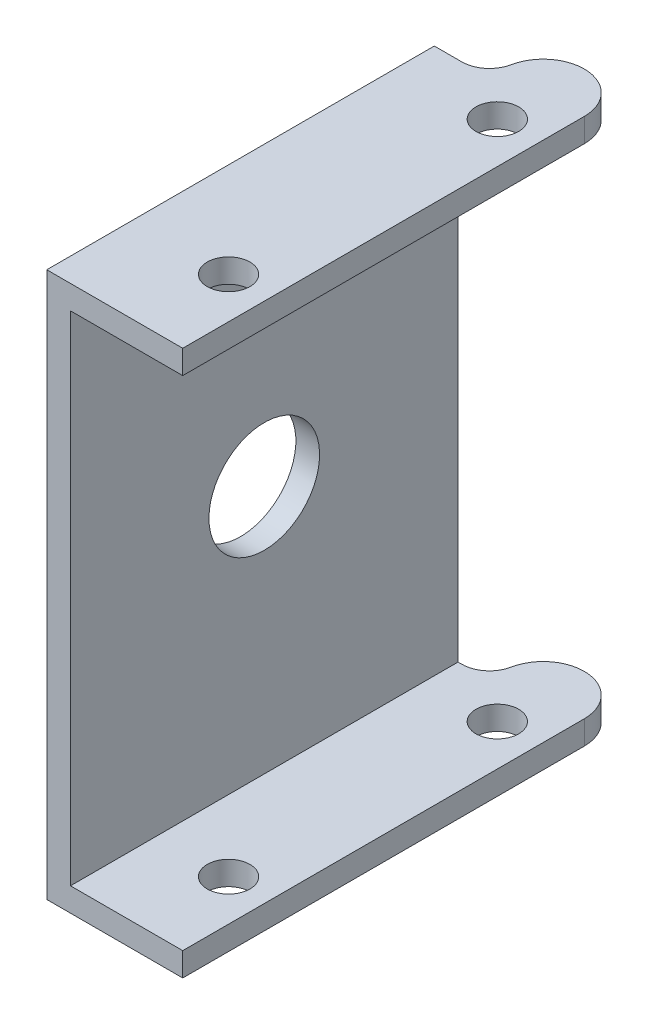
ISO-10303-21;
HEADER;
FILE_DESCRIPTION(('STEP AP214'),'2;1');
FILE_NAME('part.step','',(''),(''),'','','');
FILE_SCHEMA(('AUTOMOTIVE_DESIGN { 1 0 10303 214 1 1 1 1 }'));
ENDSEC;
DATA;
#1=APPLICATION_CONTEXT('core data for automotive mechanical design processes');
#2=APPLICATION_PROTOCOL_DEFINITION('international standard','automotive_design',2000,#1);
#3=PRODUCT_CONTEXT('',#1,'mechanical');
#4=PRODUCT('Part','Part','',(#3));
#5=PRODUCT_RELATED_PRODUCT_CATEGORY('part','',(#4));
#6=PRODUCT_DEFINITION_FORMATION('','',#4);
#7=PRODUCT_DEFINITION_CONTEXT('part definition',#1,'design');
#8=PRODUCT_DEFINITION('design','',#6,#7);
#9=PRODUCT_DEFINITION_SHAPE('','',#8);
#10=(LENGTH_UNIT() NAMED_UNIT(*) SI_UNIT(.MILLI.,.METRE.));
#11=(NAMED_UNIT(*) PLANE_ANGLE_UNIT() SI_UNIT($,.RADIAN.));
#12=(NAMED_UNIT(*) SI_UNIT($,.STERADIAN.) SOLID_ANGLE_UNIT());
#13=UNCERTAINTY_MEASURE_WITH_UNIT(LENGTH_MEASURE(1.E-05),#10,'distance_accuracy_value','');
#14=(GEOMETRIC_REPRESENTATION_CONTEXT(3) GLOBAL_UNCERTAINTY_ASSIGNED_CONTEXT((#13)) GLOBAL_UNIT_ASSIGNED_CONTEXT((#10,
#11,#12)) REPRESENTATION_CONTEXT('',''));
#15=CARTESIAN_POINT('',(0.,0.,0.));
#16=DIRECTION('',(0.,0.,1.));
#17=DIRECTION('',(1.,0.,0.));
#18=AXIS2_PLACEMENT_3D('',#15,#16,#17);
#19=CARTESIAN_POINT('',(8.6,0.,14.));
#20=DIRECTION('',(0.,1.,0.));
#21=DIRECTION('',(-1.,0.,0.));
#22=AXIS2_PLACEMENT_3D('',#19,#20,#21);
#23=PLANE('',#22);
#24=CARTESIAN_POINT('',(6.,0.,8.5));
#25=DIRECTION('',(0.,1.,0.));
#26=DIRECTION('',(-1.,0.,0.));
#27=AXIS2_PLACEMENT_3D('',#24,#25,#26);
#28=CIRCLE('',#27,1.35);
#29=CARTESIAN_POINT('',(4.65,0.,8.5));
#30=VERTEX_POINT('',#29);
#31=EDGE_CURVE('E162',#30,#30,#28,.T.);
#32=ORIENTED_EDGE('',*,*,#31,.T.);
#33=EDGE_LOOP('',(#32));
#34=FACE_BOUND('',#33,.T.);
#35=CARTESIAN_POINT('',(6.,0.,-8.5));
#36=DIRECTION('',(0.,1.,0.));
#37=DIRECTION('',(-1.,0.,0.));
#38=AXIS2_PLACEMENT_3D('',#35,#36,#37);
#39=CIRCLE('',#38,1.35);
#40=CARTESIAN_POINT('',(4.65,0.,-8.5));
#41=VERTEX_POINT('',#40);
#42=EDGE_CURVE('E174',#41,#41,#39,.T.);
#43=ORIENTED_EDGE('',*,*,#42,.T.);
#44=EDGE_LOOP('',(#43));
#45=FACE_BOUND('',#44,.T.);
#46=CARTESIAN_POINT('',(6.,0.,-11.4));
#47=DIRECTION('',(0.,1.,0.));
#48=DIRECTION('',(0.,0.,1.));
#49=AXIS2_PLACEMENT_3D('',#46,#47,#48);
#50=CIRCLE('',#49,2.6);
#51=CARTESIAN_POINT('',(8.6,0.,-11.4));
#52=VERTEX_POINT('',#51);
#53=CARTESIAN_POINT('',(3.4511622832782,0.,-11.9132507124364));
#54=VERTEX_POINT('',#53);
#55=EDGE_CURVE('E121',#52,#54,#50,.T.);
#56=ORIENTED_EDGE('',*,*,#55,.F.);
#57=DIRECTION('',(0.,0.,-1.));
#58=VECTOR('',#57,1.);
#59=CARTESIAN_POINT('',(8.6,0.,14.));
#60=LINE('',#59,#58);
#61=CARTESIAN_POINT('',(8.6,0.,14.));
#62=VERTEX_POINT('',#61);
#63=EDGE_CURVE('E11',#62,#52,#60,.T.);
#64=ORIENTED_EDGE('',*,*,#63,.F.);
#65=DIRECTION('',(1.,0.,0.));
#66=VECTOR('',#65,1.);
#67=CARTESIAN_POINT('',(8.6,0.,14.));
#68=LINE('',#67,#66);
#69=CARTESIAN_POINT('',(0.,0.,14.));
#70=VERTEX_POINT('',#69);
#71=EDGE_CURVE('E185',#70,#62,#68,.T.);
#72=ORIENTED_EDGE('',*,*,#71,.F.);
#73=DIRECTION('',(0.,0.,-1.));
#74=VECTOR('',#73,1.);
#75=CARTESIAN_POINT('',(0.,0.,14.));
#76=LINE('',#75,#74);
#77=CARTESIAN_POINT('',(0.,0.,-10.514544668059));
#78=VERTEX_POINT('',#77);
#79=EDGE_CURVE('E125',#70,#78,#76,.T.);
#80=ORIENTED_EDGE('',*,*,#79,.T.);
#81=DIRECTION('',(-1.,0.,0.));
#82=VECTOR('',#81,1.);
#83=CARTESIAN_POINT('',(0.,0.,-10.514544668059));
#84=LINE('',#83,#82);
#85=CARTESIAN_POINT('',(1.74272766597048,0.,-10.514544668059));
#86=VERTEX_POINT('',#85);
#87=EDGE_CURVE('E30',#86,#78,#84,.T.);
#88=ORIENTED_EDGE('',*,*,#87,.F.);
#89=CARTESIAN_POINT('',(1.74272766597048,0.,-12.2572723340295));
#90=DIRECTION('',(0.,1.,0.));
#91=DIRECTION('',(0.,0.,1.));
#92=AXIS2_PLACEMENT_3D('',#89,#90,#91);
#93=CIRCLE('',#92,1.74272766597049);
#94=EDGE_CURVE('E115',#86,#54,#93,.T.);
#95=ORIENTED_EDGE('',*,*,#94,.T.);
#96=EDGE_LOOP('',(#56,#64,#72,#80,#88,#95));
#97=FACE_BOUND('',#96,.T.);
#98=ADVANCED_FACE('F16',(#34,#45,#97),#23,.F.);
#99=CARTESIAN_POINT('',(1.5,1.5,14.));
#100=DIRECTION('',(0.,-1.,0.));
#101=DIRECTION('',(0.,0.,-1.));
#102=AXIS2_PLACEMENT_3D('',#99,#100,#101);
#103=PLANE('',#102);
#104=CARTESIAN_POINT('',(6.,1.5,8.5));
#105=DIRECTION('',(0.,-1.,0.));
#106=DIRECTION('',(0.,0.,-1.));
#107=AXIS2_PLACEMENT_3D('',#104,#105,#106);
#108=CIRCLE('',#107,1.35);
#109=CARTESIAN_POINT('',(6.,1.5,7.15));
#110=VERTEX_POINT('',#109);
#111=EDGE_CURVE('E170',#110,#110,#108,.T.);
#112=ORIENTED_EDGE('',*,*,#111,.T.);
#113=EDGE_LOOP('',(#112));
#114=FACE_BOUND('',#113,.T.);
#115=CARTESIAN_POINT('',(6.,1.5,-8.5));
#116=DIRECTION('',(0.,-1.,0.));
#117=DIRECTION('',(0.,0.,-1.));
#118=AXIS2_PLACEMENT_3D('',#115,#116,#117);
#119=CIRCLE('',#118,1.35);
#120=CARTESIAN_POINT('',(6.,1.5,-9.85));
#121=VERTEX_POINT('',#120);
#122=EDGE_CURVE('E182',#121,#121,#119,.T.);
#123=ORIENTED_EDGE('',*,*,#122,.T.);
#124=EDGE_LOOP('',(#123));
#125=FACE_BOUND('',#124,.T.);
#126=DIRECTION('',(0.,0.,-1.));
#127=VECTOR('',#126,1.);
#128=CARTESIAN_POINT('',(8.6,1.5,14.));
#129=LINE('',#128,#127);
#130=CARTESIAN_POINT('',(8.6,1.5,14.));
#131=VERTEX_POINT('',#130);
#132=CARTESIAN_POINT('',(8.6,1.5,-11.4));
#133=VERTEX_POINT('',#132);
#134=EDGE_CURVE('E23',#131,#133,#129,.T.);
#135=ORIENTED_EDGE('',*,*,#134,.T.);
#136=CARTESIAN_POINT('',(6.,1.5,-11.4));
#137=DIRECTION('',(0.,-1.,0.));
#138=DIRECTION('',(0.,0.,-1.));
#139=AXIS2_PLACEMENT_3D('',#136,#137,#138);
#140=CIRCLE('',#139,2.6);
#141=CARTESIAN_POINT('',(3.4511622832782,1.5,-11.9132507124364));
#142=VERTEX_POINT('',#141);
#143=EDGE_CURVE('E144',#142,#133,#140,.T.);
#144=ORIENTED_EDGE('',*,*,#143,.F.);
#145=CARTESIAN_POINT('',(1.74272766597048,1.5,-12.2572723340295));
#146=DIRECTION('',(0.,-1.,0.));
#147=DIRECTION('',(0.,0.,-1.));
#148=AXIS2_PLACEMENT_3D('',#145,#146,#147);
#149=CIRCLE('',#148,1.74272766597049);
#150=CARTESIAN_POINT('',(1.74272766597048,1.5,-10.514544668059));
#151=VERTEX_POINT('',#150);
#152=EDGE_CURVE('E159',#142,#151,#149,.T.);
#153=ORIENTED_EDGE('',*,*,#152,.T.);
#154=DIRECTION('',(1.,0.,0.));
#155=VECTOR('',#154,1.);
#156=CARTESIAN_POINT('',(1.5,1.5,-10.514544668059));
#157=LINE('',#156,#155);
#158=CARTESIAN_POINT('',(1.5,1.5,-10.514544668059));
#159=VERTEX_POINT('',#158);
#160=EDGE_CURVE('E107',#159,#151,#157,.T.);
#161=ORIENTED_EDGE('',*,*,#160,.F.);
#162=DIRECTION('',(0.,0.,-1.));
#163=VECTOR('',#162,1.);
#164=CARTESIAN_POINT('',(1.5,1.5,14.));
#165=LINE('',#164,#163);
#166=CARTESIAN_POINT('',(1.5,1.5,14.));
#167=VERTEX_POINT('',#166);
#168=EDGE_CURVE('E213',#167,#159,#165,.T.);
#169=ORIENTED_EDGE('',*,*,#168,.F.);
#170=DIRECTION('',(-1.,0.,0.));
#171=VECTOR('',#170,1.);
#172=CARTESIAN_POINT('',(1.5,1.5,14.));
#173=LINE('',#172,#171);
#174=EDGE_CURVE('E189',#131,#167,#173,.T.);
#175=ORIENTED_EDGE('',*,*,#174,.F.);
#176=EDGE_LOOP('',(#135,#144,#153,#161,#169,#175));
#177=FACE_BOUND('',#176,.T.);
#178=ADVANCED_FACE('F220',(#114,#125,#177),#103,.F.);
#179=CARTESIAN_POINT('',(1.5,33.,14.));
#180=DIRECTION('',(-1.,0.,0.));
#181=DIRECTION('',(0.,-1.,0.));
#182=AXIS2_PLACEMENT_3D('',#179,#180,#181);
#183=PLANE('',#182);
#184=CARTESIAN_POINT('',(1.5,17.25,1.74272766597048));
#185=DIRECTION('',(-1.,0.,0.));
#186=DIRECTION('',(0.,-1.,0.));
#187=AXIS2_PLACEMENT_3D('',#184,#185,#186);
#188=CIRCLE('',#187,3.5);
#189=CARTESIAN_POINT('',(1.5,13.75,1.74272766597048));
#190=VERTEX_POINT('',#189);
#191=EDGE_CURVE('E131',#190,#190,#188,.T.);
#192=ORIENTED_EDGE('',*,*,#191,.T.);
#193=EDGE_LOOP('',(#192));
#194=FACE_BOUND('',#193,.T.);
#195=DIRECTION('',(0.,-1.,0.));
#196=VECTOR('',#195,1.);
#197=CARTESIAN_POINT('',(1.5,33.,-10.514544668059));
#198=LINE('',#197,#196);
#199=CARTESIAN_POINT('',(1.5,33.,-10.514544668059));
#200=VERTEX_POINT('',#199);
#201=EDGE_CURVE('E153',#200,#159,#198,.T.);
#202=ORIENTED_EDGE('',*,*,#201,.F.);
#203=DIRECTION('',(0.,0.,-1.));
#204=VECTOR('',#203,1.);
#205=CARTESIAN_POINT('',(1.5,33.,14.));
#206=LINE('',#205,#204);
#207=CARTESIAN_POINT('',(1.5,33.,14.));
#208=VERTEX_POINT('',#207);
#209=EDGE_CURVE('E210',#208,#200,#206,.T.);
#210=ORIENTED_EDGE('',*,*,#209,.F.);
#211=DIRECTION('',(0.,1.,0.));
#212=VECTOR('',#211,1.);
#213=CARTESIAN_POINT('',(1.5,33.,14.));
#214=LINE('',#213,#212);
#215=EDGE_CURVE('E191',#167,#208,#214,.T.);
#216=ORIENTED_EDGE('',*,*,#215,.F.);
#217=ORIENTED_EDGE('',*,*,#168,.T.);
#218=EDGE_LOOP('',(#202,#210,#216,#217));
#219=FACE_BOUND('',#218,.T.);
#220=ADVANCED_FACE('F232',(#194,#219),#183,.F.);
#221=CARTESIAN_POINT('',(8.6,33.,14.));
#222=DIRECTION('',(0.,1.,0.));
#223=DIRECTION('',(0.,0.,1.));
#224=AXIS2_PLACEMENT_3D('',#221,#222,#223);
#225=PLANE('',#224);
#226=CARTESIAN_POINT('',(6.,33.,8.5));
#227=DIRECTION('',(0.,1.,0.));
#228=DIRECTION('',(0.,0.,1.));
#229=AXIS2_PLACEMENT_3D('',#226,#227,#228);
#230=CIRCLE('',#229,1.35);
#231=CARTESIAN_POINT('',(6.,33.,9.85));
#232=VERTEX_POINT('',#231);
#233=EDGE_CURVE('E165',#232,#232,#230,.T.);
#234=ORIENTED_EDGE('',*,*,#233,.T.);
#235=EDGE_LOOP('',(#234));
#236=FACE_BOUND('',#235,.T.);
#237=CARTESIAN_POINT('',(6.,33.,-8.5));
#238=DIRECTION('',(0.,1.,0.));
#239=DIRECTION('',(0.,0.,1.));
#240=AXIS2_PLACEMENT_3D('',#237,#238,#239);
#241=CIRCLE('',#240,1.35);
#242=CARTESIAN_POINT('',(6.,33.,-7.15));
#243=VERTEX_POINT('',#242);
#244=EDGE_CURVE('E177',#243,#243,#241,.T.);
#245=ORIENTED_EDGE('',*,*,#244,.T.);
#246=EDGE_LOOP('',(#245));
#247=FACE_BOUND('',#246,.T.);
#248=CARTESIAN_POINT('',(6.,33.,-11.4));
#249=DIRECTION('',(0.,1.,0.));
#250=DIRECTION('',(0.,0.,1.));
#251=AXIS2_PLACEMENT_3D('',#248,#249,#250);
#252=CIRCLE('',#251,2.6);
#253=CARTESIAN_POINT('',(8.6,33.,-11.4));
#254=VERTEX_POINT('',#253);
#255=CARTESIAN_POINT('',(3.4511622832782,33.,-11.9132507124364));
#256=VERTEX_POINT('',#255);
#257=EDGE_CURVE('E148',#254,#256,#252,.T.);
#258=ORIENTED_EDGE('',*,*,#257,.F.);
#259=DIRECTION('',(0.,0.,-1.));
#260=VECTOR('',#259,1.);
#261=CARTESIAN_POINT('',(8.6,33.,14.));
#262=LINE('',#261,#260);
#263=CARTESIAN_POINT('',(8.6,33.,14.));
#264=VERTEX_POINT('',#263);
#265=EDGE_CURVE('E207',#264,#254,#262,.T.);
#266=ORIENTED_EDGE('',*,*,#265,.F.);
#267=DIRECTION('',(1.,0.,0.));
#268=VECTOR('',#267,1.);
#269=CARTESIAN_POINT('',(8.6,33.,14.));
#270=LINE('',#269,#268);
#271=EDGE_CURVE('E193',#208,#264,#270,.T.);
#272=ORIENTED_EDGE('',*,*,#271,.F.);
#273=ORIENTED_EDGE('',*,*,#209,.T.);
#274=DIRECTION('',(-1.,0.,0.));
#275=VECTOR('',#274,1.);
#276=CARTESIAN_POINT('',(8.6,33.,-10.514544668059));
#277=LINE('',#276,#275);
#278=CARTESIAN_POINT('',(1.74272766597048,33.,-10.514544668059));
#279=VERTEX_POINT('',#278);
#280=EDGE_CURVE('E150',#279,#200,#277,.T.);
#281=ORIENTED_EDGE('',*,*,#280,.F.);
#282=CARTESIAN_POINT('',(1.74272766597048,33.,-12.2572723340295));
#283=DIRECTION('',(0.,1.,0.));
#284=DIRECTION('',(0.,0.,1.));
#285=AXIS2_PLACEMENT_3D('',#282,#283,#284);
#286=CIRCLE('',#285,1.74272766597049);
#287=EDGE_CURVE('E156',#279,#256,#286,.T.);
#288=ORIENTED_EDGE('',*,*,#287,.T.);
#289=EDGE_LOOP('',(#258,#266,#272,#273,#281,#288));
#290=FACE_BOUND('',#289,.T.);
#291=ADVANCED_FACE('F238',(#236,#247,#290),#225,.F.);
#292=CARTESIAN_POINT('',(0.,34.5,14.));
#293=DIRECTION('',(0.,-1.,0.));
#294=DIRECTION('',(0.,0.,-1.));
#295=AXIS2_PLACEMENT_3D('',#292,#293,#294);
#296=PLANE('',#295);
#297=CARTESIAN_POINT('',(6.,34.5,8.5));
#298=DIRECTION('',(0.,1.,0.));
#299=DIRECTION('',(-1.,0.,0.));
#300=AXIS2_PLACEMENT_3D('',#297,#298,#299);
#301=CIRCLE('',#300,1.35);
#302=CARTESIAN_POINT('',(4.65,34.5,8.5));
#303=VERTEX_POINT('',#302);
#304=EDGE_CURVE('E161',#303,#303,#301,.T.);
#305=ORIENTED_EDGE('',*,*,#304,.F.);
#306=EDGE_LOOP('',(#305));
#307=FACE_BOUND('',#306,.T.);
#308=CARTESIAN_POINT('',(6.,34.5,-8.5));
#309=DIRECTION('',(0.,1.,0.));
#310=DIRECTION('',(-1.,0.,0.));
#311=AXIS2_PLACEMENT_3D('',#308,#309,#310);
#312=CIRCLE('',#311,1.35);
#313=CARTESIAN_POINT('',(4.65,34.5,-8.5));
#314=VERTEX_POINT('',#313);
#315=EDGE_CURVE('E173',#314,#314,#312,.T.);
#316=ORIENTED_EDGE('',*,*,#315,.F.);
#317=EDGE_LOOP('',(#316));
#318=FACE_BOUND('',#317,.T.);
#319=CARTESIAN_POINT('',(6.,34.5,-11.4));
#320=DIRECTION('',(0.,1.,0.));
#321=DIRECTION('',(0.,0.,1.));
#322=AXIS2_PLACEMENT_3D('',#319,#320,#321);
#323=CIRCLE('',#322,2.6);
#324=CARTESIAN_POINT('',(8.6,34.5,-11.4));
#325=VERTEX_POINT('',#324);
#326=CARTESIAN_POINT('',(3.4511622832782,34.5,-11.9132507124364));
#327=VERTEX_POINT('',#326);
#328=EDGE_CURVE('E126',#325,#327,#323,.T.);
#329=ORIENTED_EDGE('',*,*,#328,.T.);
#330=CARTESIAN_POINT('',(1.74272766597048,34.5,-12.2572723340295));
#331=DIRECTION('',(0.,1.,0.));
#332=DIRECTION('',(0.,0.,1.));
#333=AXIS2_PLACEMENT_3D('',#330,#331,#332);
#334=CIRCLE('',#333,1.74272766597049);
#335=CARTESIAN_POINT('',(1.74272766597048,34.5,-10.514544668059));
#336=VERTEX_POINT('',#335);
#337=EDGE_CURVE('E128',#336,#327,#334,.T.);
#338=ORIENTED_EDGE('',*,*,#337,.F.);
#339=DIRECTION('',(-1.,0.,0.));
#340=VECTOR('',#339,1.);
#341=CARTESIAN_POINT('',(0.,34.5,-10.514544668059));
#342=LINE('',#341,#340);
#343=CARTESIAN_POINT('',(0.,34.5,-10.514544668059));
#344=VERTEX_POINT('',#343);
#345=EDGE_CURVE('E136',#336,#344,#342,.T.);
#346=ORIENTED_EDGE('',*,*,#345,.T.);
#347=DIRECTION('',(0.,0.,-1.));
#348=VECTOR('',#347,1.);
#349=CARTESIAN_POINT('',(0.,34.5,14.));
#350=LINE('',#349,#348);
#351=CARTESIAN_POINT('',(0.,34.5,14.));
#352=VERTEX_POINT('',#351);
#353=EDGE_CURVE('E201',#352,#344,#350,.T.);
#354=ORIENTED_EDGE('',*,*,#353,.F.);
#355=DIRECTION('',(-1.,0.,0.));
#356=VECTOR('',#355,1.);
#357=CARTESIAN_POINT('',(0.,34.5,14.));
#358=LINE('',#357,#356);
#359=CARTESIAN_POINT('',(8.6,34.5,14.));
#360=VERTEX_POINT('',#359);
#361=EDGE_CURVE('E197',#360,#352,#358,.T.);
#362=ORIENTED_EDGE('',*,*,#361,.F.);
#363=DIRECTION('',(0.,0.,-1.));
#364=VECTOR('',#363,1.);
#365=CARTESIAN_POINT('',(8.6,34.5,14.));
#366=LINE('',#365,#364);
#367=EDGE_CURVE('E204',#360,#325,#366,.T.);
#368=ORIENTED_EDGE('',*,*,#367,.T.);
#369=EDGE_LOOP('',(#329,#338,#346,#354,#362,#368));
#370=FACE_BOUND('',#369,.T.);
#371=ADVANCED_FACE('F247',(#307,#318,#370),#296,.F.);
#372=CARTESIAN_POINT('',(0.,0.,14.));
#373=DIRECTION('',(1.,0.,0.));
#374=DIRECTION('',(0.,0.,-1.));
#375=AXIS2_PLACEMENT_3D('',#372,#373,#374);
#376=PLANE('',#375);
#377=CARTESIAN_POINT('',(0.,17.25,1.74272766597048));
#378=DIRECTION('',(-1.,0.,0.));
#379=DIRECTION('',(0.,0.,1.));
#380=AXIS2_PLACEMENT_3D('',#377,#378,#379);
#381=CIRCLE('',#380,3.5);
#382=CARTESIAN_POINT('',(0.,17.25,5.24272766597048));
#383=VERTEX_POINT('',#382);
#384=EDGE_CURVE('E481',#383,#383,#381,.T.);
#385=ORIENTED_EDGE('',*,*,#384,.F.);
#386=EDGE_LOOP('',(#385));
#387=FACE_BOUND('',#386,.T.);
#388=DIRECTION('',(0.,1.,0.));
#389=VECTOR('',#388,1.);
#390=CARTESIAN_POINT('',(0.,0.,-10.514544668059));
#391=LINE('',#390,#389);
#392=EDGE_CURVE('E135',#78,#344,#391,.T.);
#393=ORIENTED_EDGE('',*,*,#392,.F.);
#394=ORIENTED_EDGE('',*,*,#79,.F.);
#395=DIRECTION('',(0.,-1.,0.));
#396=VECTOR('',#395,1.);
#397=CARTESIAN_POINT('',(0.,0.,14.));
#398=LINE('',#397,#396);
#399=EDGE_CURVE('E38',#352,#70,#398,.T.);
#400=ORIENTED_EDGE('',*,*,#399,.F.);
#401=ORIENTED_EDGE('',*,*,#353,.T.);
#402=EDGE_LOOP('',(#393,#394,#400,#401));
#403=FACE_BOUND('',#402,.T.);
#404=ADVANCED_FACE('F251',(#387,#403),#376,.F.);
#405=CARTESIAN_POINT('',(8.6,1.5,14.));
#406=DIRECTION('',(-1.,0.,0.));
#407=DIRECTION('',(0.,0.,1.));
#408=AXIS2_PLACEMENT_3D('',#405,#406,#407);
#409=PLANE('',#408);
#410=ORIENTED_EDGE('',*,*,#63,.T.);
#411=DIRECTION('',(0.,1.,0.));
#412=VECTOR('',#411,1.);
#413=CARTESIAN_POINT('',(8.6,0.,-11.4));
#414=LINE('',#413,#412);
#415=EDGE_CURVE('E141',#52,#133,#414,.T.);
#416=ORIENTED_EDGE('',*,*,#415,.T.);
#417=ORIENTED_EDGE('',*,*,#134,.F.);
#418=DIRECTION('',(0.,1.,0.));
#419=VECTOR('',#418,1.);
#420=CARTESIAN_POINT('',(8.6,1.5,14.));
#421=LINE('',#420,#419);
#422=EDGE_CURVE('E187',#62,#131,#421,.T.);
#423=ORIENTED_EDGE('',*,*,#422,.F.);
#424=EDGE_LOOP('',(#410,#416,#417,#423));
#425=FACE_BOUND('',#424,.T.);
#426=ADVANCED_FACE('F223',(#425),#409,.F.);
#427=CARTESIAN_POINT('',(8.6,34.5,14.));
#428=DIRECTION('',(-1.,0.,0.));
#429=DIRECTION('',(0.,-1.,0.));
#430=AXIS2_PLACEMENT_3D('',#427,#428,#429);
#431=PLANE('',#430);
#432=ORIENTED_EDGE('',*,*,#265,.T.);
#433=EDGE_CURVE('E145',#254,#325,#414,.T.);
#434=ORIENTED_EDGE('',*,*,#433,.T.);
#435=ORIENTED_EDGE('',*,*,#367,.F.);
#436=DIRECTION('',(0.,1.,0.));
#437=VECTOR('',#436,1.);
#438=CARTESIAN_POINT('',(8.6,34.5,14.));
#439=LINE('',#438,#437);
#440=EDGE_CURVE('E195',#264,#360,#439,.T.);
#441=ORIENTED_EDGE('',*,*,#440,.F.);
#442=EDGE_LOOP('',(#432,#434,#435,#441));
#443=FACE_BOUND('',#442,.T.);
#444=ADVANCED_FACE('F245',(#443),#431,.F.);
#445=CARTESIAN_POINT('',(0.,0.,14.));
#446=DIRECTION('',(0.,0.,-1.));
#447=DIRECTION('',(-1.,0.,0.));
#448=AXIS2_PLACEMENT_3D('',#445,#446,#447);
#449=PLANE('',#448);
#450=ORIENTED_EDGE('',*,*,#71,.T.);
#451=ORIENTED_EDGE('',*,*,#422,.T.);
#452=ORIENTED_EDGE('',*,*,#174,.T.);
#453=ORIENTED_EDGE('',*,*,#215,.T.);
#454=ORIENTED_EDGE('',*,*,#271,.T.);
#455=ORIENTED_EDGE('',*,*,#440,.T.);
#456=ORIENTED_EDGE('',*,*,#361,.T.);
#457=ORIENTED_EDGE('',*,*,#399,.T.);
#458=EDGE_LOOP('',(#450,#451,#452,#453,#454,#455,#456,#457));
#459=FACE_BOUND('',#458,.T.);
#460=ADVANCED_FACE('F227',(#459),#449,.F.);
#461=CARTESIAN_POINT('',(6.,0.,-8.5));
#462=DIRECTION('',(0.,1.,0.));
#463=DIRECTION('',(-1.,0.,0.));
#464=AXIS2_PLACEMENT_3D('',#461,#462,#463);
#465=CYLINDRICAL_SURFACE('',#464,1.35);
#466=ORIENTED_EDGE('',*,*,#315,.T.);
#467=EDGE_LOOP('',(#466));
#468=FACE_BOUND('',#467,.T.);
#469=ORIENTED_EDGE('',*,*,#244,.F.);
#470=EDGE_LOOP('',(#469));
#471=FACE_BOUND('',#470,.T.);
#472=ADVANCED_FACE('F285',(#468,#471),#465,.F.);
#473=ORIENTED_EDGE('',*,*,#42,.F.);
#474=EDGE_LOOP('',(#473));
#475=FACE_BOUND('',#474,.T.);
#476=ORIENTED_EDGE('',*,*,#122,.F.);
#477=EDGE_LOOP('',(#476));
#478=FACE_BOUND('',#477,.T.);
#479=ADVANCED_FACE('F281',(#475,#478),#465,.F.);
#480=CARTESIAN_POINT('',(6.,0.,8.5));
#481=DIRECTION('',(0.,1.,0.));
#482=DIRECTION('',(-1.,0.,0.));
#483=AXIS2_PLACEMENT_3D('',#480,#481,#482);
#484=CYLINDRICAL_SURFACE('',#483,1.35);
#485=ORIENTED_EDGE('',*,*,#304,.T.);
#486=EDGE_LOOP('',(#485));
#487=FACE_BOUND('',#486,.T.);
#488=ORIENTED_EDGE('',*,*,#233,.F.);
#489=EDGE_LOOP('',(#488));
#490=FACE_BOUND('',#489,.T.);
#491=ADVANCED_FACE('F284',(#487,#490),#484,.F.);
#492=ORIENTED_EDGE('',*,*,#31,.F.);
#493=EDGE_LOOP('',(#492));
#494=FACE_BOUND('',#493,.T.);
#495=ORIENTED_EDGE('',*,*,#111,.F.);
#496=EDGE_LOOP('',(#495));
#497=FACE_BOUND('',#496,.T.);
#498=ADVANCED_FACE('F293',(#494,#497),#484,.F.);
#499=CARTESIAN_POINT('',(1.74272766597048,0.,-12.2572723340295));
#500=DIRECTION('',(0.,1.,0.));
#501=DIRECTION('',(0.,0.,1.));
#502=AXIS2_PLACEMENT_3D('',#499,#500,#501);
#503=CYLINDRICAL_SURFACE('',#502,1.74272766597049);
#504=DIRECTION('',(0.,1.,0.));
#505=VECTOR('',#504,1.);
#506=CARTESIAN_POINT('',(3.4511622832782,0.,-11.9132507124364));
#507=LINE('',#506,#505);
#508=EDGE_CURVE('E118',#54,#142,#507,.T.);
#509=ORIENTED_EDGE('',*,*,#508,.F.);
#510=ORIENTED_EDGE('',*,*,#94,.F.);
#511=DIRECTION('',(0.,1.,0.));
#512=VECTOR('',#511,1.);
#513=CARTESIAN_POINT('',(1.74272766597048,0.,-10.514544668059));
#514=LINE('',#513,#512);
#515=EDGE_CURVE('E103',#86,#151,#514,.T.);
#516=ORIENTED_EDGE('',*,*,#515,.T.);
#517=ORIENTED_EDGE('',*,*,#152,.F.);
#518=EDGE_LOOP('',(#509,#510,#516,#517));
#519=FACE_BOUND('',#518,.T.);
#520=ADVANCED_FACE('F116',(#519),#503,.F.);
#521=EDGE_CURVE('E111',#279,#336,#514,.T.);
#522=ORIENTED_EDGE('',*,*,#521,.T.);
#523=ORIENTED_EDGE('',*,*,#337,.T.);
#524=EDGE_CURVE('E110',#256,#327,#507,.T.);
#525=ORIENTED_EDGE('',*,*,#524,.F.);
#526=ORIENTED_EDGE('',*,*,#287,.F.);
#527=EDGE_LOOP('',(#522,#523,#525,#526));
#528=FACE_BOUND('',#527,.T.);
#529=ADVANCED_FACE('F256',(#528),#503,.F.);
#530=CARTESIAN_POINT('',(0.,0.,-10.514544668059));
#531=DIRECTION('',(0.,0.,-1.));
#532=DIRECTION('',(-1.,0.,0.));
#533=AXIS2_PLACEMENT_3D('',#530,#531,#532);
#534=PLANE('',#533);
#535=ORIENTED_EDGE('',*,*,#160,.T.);
#536=ORIENTED_EDGE('',*,*,#515,.F.);
#537=ORIENTED_EDGE('',*,*,#87,.T.);
#538=ORIENTED_EDGE('',*,*,#392,.T.);
#539=ORIENTED_EDGE('',*,*,#345,.F.);
#540=ORIENTED_EDGE('',*,*,#521,.F.);
#541=ORIENTED_EDGE('',*,*,#280,.T.);
#542=ORIENTED_EDGE('',*,*,#201,.T.);
#543=EDGE_LOOP('',(#535,#536,#537,#538,#539,#540,#541,#542));
#544=FACE_BOUND('',#543,.T.);
#545=ADVANCED_FACE('F105',(#544),#534,.T.);
#546=CARTESIAN_POINT('',(6.,0.,-11.4));
#547=DIRECTION('',(0.,1.,0.));
#548=DIRECTION('',(0.,0.,1.));
#549=AXIS2_PLACEMENT_3D('',#546,#547,#548);
#550=CYLINDRICAL_SURFACE('',#549,2.6);
#551=ORIENTED_EDGE('',*,*,#143,.T.);
#552=ORIENTED_EDGE('',*,*,#415,.F.);
#553=ORIENTED_EDGE('',*,*,#55,.T.);
#554=ORIENTED_EDGE('',*,*,#508,.T.);
#555=EDGE_LOOP('',(#551,#552,#553,#554));
#556=FACE_BOUND('',#555,.T.);
#557=ADVANCED_FACE('F226',(#556),#550,.T.);
#558=ORIENTED_EDGE('',*,*,#257,.T.);
#559=ORIENTED_EDGE('',*,*,#524,.T.);
#560=ORIENTED_EDGE('',*,*,#328,.F.);
#561=ORIENTED_EDGE('',*,*,#433,.F.);
#562=EDGE_LOOP('',(#558,#559,#560,#561));
#563=FACE_BOUND('',#562,.T.);
#564=ADVANCED_FACE('F258',(#563),#550,.T.);
#565=CARTESIAN_POINT('',(8.6,17.25,1.74272766597048));
#566=DIRECTION('',(-1.,0.,0.));
#567=DIRECTION('',(0.,0.,1.));
#568=AXIS2_PLACEMENT_3D('',#565,#566,#567);
#569=CYLINDRICAL_SURFACE('',#568,3.5);
#570=ORIENTED_EDGE('',*,*,#384,.T.);
#571=EDGE_LOOP('',(#570));
#572=FACE_BOUND('',#571,.T.);
#573=ORIENTED_EDGE('',*,*,#191,.F.);
#574=EDGE_LOOP('',(#573));
#575=FACE_BOUND('',#574,.T.);
#576=ADVANCED_FACE('F260',(#572,#575),#569,.F.);
#577=CLOSED_SHELL('',(#98,#178,#220,#291,#371,#404,#426,#444,#460,#472,#479,#491,#498,#520,#529,
#545,#557,#564,#576));
#578=MANIFOLD_SOLID_BREP('B1',#577);
#579=ADVANCED_BREP_SHAPE_REPRESENTATION('',(#18,#578),#14);
#580=SHAPE_DEFINITION_REPRESENTATION(#9,#579);
ENDSEC;
END-ISO-10303-21;
